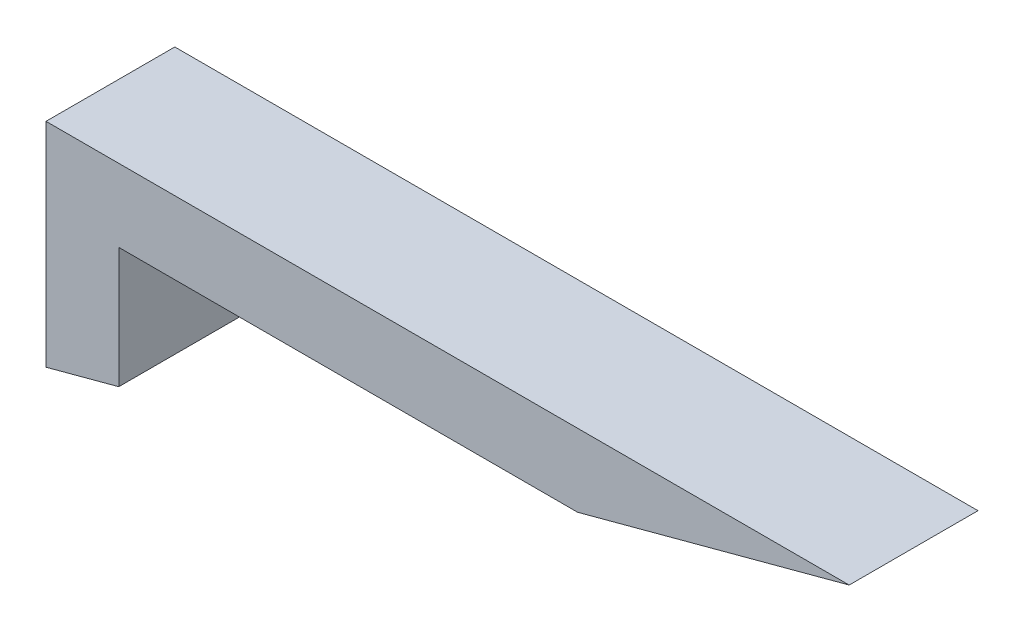
ISO-10303-21;
HEADER;
FILE_DESCRIPTION(('STEP AP214'),'2;1');
FILE_NAME('part.step','',(''),(''),'','','');
FILE_SCHEMA(('AUTOMOTIVE_DESIGN { 1 0 10303 214 1 1 1 1 }'));
ENDSEC;
DATA;
#1=APPLICATION_CONTEXT('core data for automotive mechanical design processes');
#2=APPLICATION_PROTOCOL_DEFINITION('international standard','automotive_design',2000,#1);
#3=PRODUCT_CONTEXT('',#1,'mechanical');
#4=PRODUCT('Part','Part','',(#3));
#5=PRODUCT_RELATED_PRODUCT_CATEGORY('part','',(#4));
#6=PRODUCT_DEFINITION_FORMATION('','',#4);
#7=PRODUCT_DEFINITION_CONTEXT('part definition',#1,'design');
#8=PRODUCT_DEFINITION('design','',#6,#7);
#9=PRODUCT_DEFINITION_SHAPE('','',#8);
#10=(LENGTH_UNIT() NAMED_UNIT(*) SI_UNIT(.MILLI.,.METRE.));
#11=(NAMED_UNIT(*) PLANE_ANGLE_UNIT() SI_UNIT($,.RADIAN.));
#12=(NAMED_UNIT(*) SI_UNIT($,.STERADIAN.) SOLID_ANGLE_UNIT());
#13=UNCERTAINTY_MEASURE_WITH_UNIT(LENGTH_MEASURE(1.E-05),#10,'distance_accuracy_value','');
#14=(GEOMETRIC_REPRESENTATION_CONTEXT(3) GLOBAL_UNCERTAINTY_ASSIGNED_CONTEXT((#13)) GLOBAL_UNIT_ASSIGNED_CONTEXT((#10,
#11,#12)) REPRESENTATION_CONTEXT('',''));
#15=CARTESIAN_POINT('',(0.,0.,0.));
#16=DIRECTION('',(0.,0.,1.));
#17=DIRECTION('',(1.,0.,0.));
#18=AXIS2_PLACEMENT_3D('',#15,#16,#17);
#19=CARTESIAN_POINT('',(12.7,0.,44.958));
#20=DIRECTION('',(-1.,0.,0.));
#21=DIRECTION('',(0.,-1.,0.));
#22=AXIS2_PLACEMENT_3D('',#19,#20,#21);
#23=PLANE('',#22);
#24=DIRECTION('',(0.,1.,0.));
#25=VECTOR('',#24,1.);
#26=CARTESIAN_POINT('',(12.7,0.,0.));
#27=LINE('',#26,#25);
#28=CARTESIAN_POINT('',(12.7,6.80590948775034,0.));
#29=VERTEX_POINT('',#28);
#30=CARTESIAN_POINT('',(12.7,48.9309360619142,0.));
#31=VERTEX_POINT('',#30);
#32=EDGE_CURVE('E130',#29,#31,#27,.T.);
#33=ORIENTED_EDGE('',*,*,#32,.T.);
#34=DIRECTION('',(0.,0.,-1.));
#35=VECTOR('',#34,1.);
#36=CARTESIAN_POINT('',(12.7,48.9309360619142,44.958));
#37=LINE('',#36,#35);
#38=CARTESIAN_POINT('',(12.7,48.9309360619142,44.958));
#39=VERTEX_POINT('',#38);
#40=EDGE_CURVE('E11',#39,#31,#37,.T.);
#41=ORIENTED_EDGE('',*,*,#40,.F.);
#42=DIRECTION('',(0.,1.,0.));
#43=VECTOR('',#42,1.);
#44=CARTESIAN_POINT('',(12.7,0.,44.958));
#45=LINE('',#44,#43);
#46=CARTESIAN_POINT('',(12.7,6.80590948775034,44.958));
#47=VERTEX_POINT('',#46);
#48=EDGE_CURVE('E150',#47,#39,#45,.T.);
#49=ORIENTED_EDGE('',*,*,#48,.F.);
#50=DIRECTION('',(0.,0.,-1.));
#51=VECTOR('',#50,1.);
#52=CARTESIAN_POINT('',(12.7,6.80590948775034,44.958));
#53=LINE('',#52,#51);
#54=EDGE_CURVE('E58',#47,#29,#53,.T.);
#55=ORIENTED_EDGE('',*,*,#54,.T.);
#56=EDGE_LOOP('',(#33,#41,#49,#55));
#57=FACE_BOUND('',#56,.T.);
#58=ADVANCED_FACE('F41',(#57),#23,.F.);
#59=CARTESIAN_POINT('',(0.,48.9309360619142,44.958));
#60=DIRECTION('',(0.,1.,0.));
#61=DIRECTION('',(0.,0.,1.));
#62=AXIS2_PLACEMENT_3D('',#59,#60,#61);
#63=PLANE('',#62);
#64=DIRECTION('',(1.,0.,0.));
#65=VECTOR('',#64,1.);
#66=CARTESIAN_POINT('',(0.,48.9309360619142,0.));
#67=LINE('',#66,#65);
#68=CARTESIAN_POINT('',(172.856591106213,48.9309360619142,0.));
#69=VERTEX_POINT('',#68);
#70=EDGE_CURVE('E133',#31,#69,#67,.T.);
#71=ORIENTED_EDGE('',*,*,#70,.T.);
#72=DIRECTION('',(0.,0.,-1.));
#73=VECTOR('',#72,1.);
#74=CARTESIAN_POINT('',(172.856591106213,48.9309360619142,44.958));
#75=LINE('',#74,#73);
#76=CARTESIAN_POINT('',(172.856591106213,48.9309360619142,44.958));
#77=VERTEX_POINT('',#76);
#78=EDGE_CURVE('E50',#77,#69,#75,.T.);
#79=ORIENTED_EDGE('',*,*,#78,.F.);
#80=DIRECTION('',(1.,0.,0.));
#81=VECTOR('',#80,1.);
#82=CARTESIAN_POINT('',(0.,48.9309360619142,44.958));
#83=LINE('',#82,#81);
#84=EDGE_CURVE('E90',#39,#77,#83,.T.);
#85=ORIENTED_EDGE('',*,*,#84,.F.);
#86=ORIENTED_EDGE('',*,*,#40,.T.);
#87=EDGE_LOOP('',(#71,#79,#85,#86));
#88=FACE_BOUND('',#87,.T.);
#89=ADVANCED_FACE('F160',(#88),#63,.F.);
#90=CARTESIAN_POINT('',(-0.653538017152202,2.4390370846899,44.958));
#91=DIRECTION('',(0.258819045102515,-0.96592582628907,0.));
#92=DIRECTION('',(0.96592582628907,0.258819045102515,0.));
#93=AXIS2_PLACEMENT_3D('',#90,#91,#92);
#94=PLANE('',#93);
#95=DIRECTION('',(-0.96592582628907,-0.258819045102514,0.));
#96=VECTOR('',#95,1.);
#97=CARTESIAN_POINT('',(-0.653538017152202,2.4390370846899,0.));
#98=LINE('',#97,#96);
#99=CARTESIAN_POINT('',(267.650681618465,74.3309360619142,0.));
#100=VERTEX_POINT('',#99);
#101=EDGE_CURVE('E137',#100,#69,#98,.T.);
#102=ORIENTED_EDGE('',*,*,#101,.F.);
#103=DIRECTION('',(0.,0.,-1.));
#104=VECTOR('',#103,1.);
#105=CARTESIAN_POINT('',(267.650681618465,74.3309360619142,44.958));
#106=LINE('',#105,#104);
#107=CARTESIAN_POINT('',(267.650681618465,74.3309360619142,44.958));
#108=VERTEX_POINT('',#107);
#109=EDGE_CURVE('E110',#108,#100,#106,.T.);
#110=ORIENTED_EDGE('',*,*,#109,.F.);
#111=DIRECTION('',(-0.96592582628907,-0.258819045102514,0.));
#112=VECTOR('',#111,1.);
#113=CARTESIAN_POINT('',(-0.653538017152202,2.4390370846899,44.958));
#114=LINE('',#113,#112);
#115=EDGE_CURVE('E119',#108,#77,#114,.T.);
#116=ORIENTED_EDGE('',*,*,#115,.T.);
#117=ORIENTED_EDGE('',*,*,#78,.T.);
#118=EDGE_LOOP('',(#102,#110,#116,#117));
#119=FACE_BOUND('',#118,.T.);
#120=ADVANCED_FACE('F159',(#119),#94,.T.);
#121=CARTESIAN_POINT('',(0.,74.3309360619142,44.958));
#122=DIRECTION('',(0.,1.,0.));
#123=DIRECTION('',(0.,0.,1.));
#124=AXIS2_PLACEMENT_3D('',#121,#122,#123);
#125=PLANE('',#124);
#126=DIRECTION('',(1.,0.,0.));
#127=VECTOR('',#126,1.);
#128=CARTESIAN_POINT('',(0.,74.3309360619142,0.));
#129=LINE('',#128,#127);
#130=CARTESIAN_POINT('',(-12.7,74.3309360619142,0.));
#131=VERTEX_POINT('',#130);
#132=EDGE_CURVE('E105',#131,#100,#129,.T.);
#133=ORIENTED_EDGE('',*,*,#132,.F.);
#134=DIRECTION('',(0.,0.,-1.));
#135=VECTOR('',#134,1.);
#136=CARTESIAN_POINT('',(-12.7,74.3309360619142,44.958));
#137=LINE('',#136,#135);
#138=CARTESIAN_POINT('',(-12.7,74.3309360619142,44.958));
#139=VERTEX_POINT('',#138);
#140=EDGE_CURVE('E100',#139,#131,#137,.T.);
#141=ORIENTED_EDGE('',*,*,#140,.F.);
#142=DIRECTION('',(1.,0.,0.));
#143=VECTOR('',#142,1.);
#144=CARTESIAN_POINT('',(0.,74.3309360619142,44.958));
#145=LINE('',#144,#143);
#146=EDGE_CURVE('E103',#139,#108,#145,.T.);
#147=ORIENTED_EDGE('',*,*,#146,.T.);
#148=ORIENTED_EDGE('',*,*,#109,.T.);
#149=EDGE_LOOP('',(#133,#141,#147,#148));
#150=FACE_BOUND('',#149,.T.);
#151=ADVANCED_FACE('F102',(#150),#125,.T.);
#152=CARTESIAN_POINT('',(-12.7,0.,44.958));
#153=DIRECTION('',(-1.,0.,0.));
#154=DIRECTION('',(0.,-1.,0.));
#155=AXIS2_PLACEMENT_3D('',#152,#153,#154);
#156=PLANE('',#155);
#157=DIRECTION('',(0.,1.,0.));
#158=VECTOR('',#157,1.);
#159=CARTESIAN_POINT('',(-12.7,0.,0.));
#160=LINE('',#159,#158);
#161=CARTESIAN_POINT('',(-12.7,0.,0.));
#162=VERTEX_POINT('',#161);
#163=EDGE_CURVE('E143',#162,#131,#160,.T.);
#164=ORIENTED_EDGE('',*,*,#163,.F.);
#165=DIRECTION('',(0.,0.,-1.));
#166=VECTOR('',#165,1.);
#167=CARTESIAN_POINT('',(-12.7,0.,44.958));
#168=LINE('',#167,#166);
#169=CARTESIAN_POINT('',(-12.7,0.,44.958));
#170=VERTEX_POINT('',#169);
#171=EDGE_CURVE('E78',#170,#162,#168,.T.);
#172=ORIENTED_EDGE('',*,*,#171,.F.);
#173=DIRECTION('',(0.,1.,0.));
#174=VECTOR('',#173,1.);
#175=CARTESIAN_POINT('',(-12.7,0.,44.958));
#176=LINE('',#175,#174);
#177=EDGE_CURVE('E117',#170,#139,#176,.T.);
#178=ORIENTED_EDGE('',*,*,#177,.T.);
#179=ORIENTED_EDGE('',*,*,#140,.T.);
#180=EDGE_LOOP('',(#164,#172,#178,#179));
#181=FACE_BOUND('',#180,.T.);
#182=ADVANCED_FACE('F122',(#181),#156,.T.);
#183=CARTESIAN_POINT('',(-0.850738685968774,3.17499999999993,44.958));
#184=DIRECTION('',(0.258819045102515,-0.96592582628907,0.));
#185=DIRECTION('',(0.96592582628907,0.258819045102515,0.));
#186=AXIS2_PLACEMENT_3D('',#183,#184,#185);
#187=PLANE('',#186);
#188=DIRECTION('',(-0.96592582628907,-0.258819045102515,0.));
#189=VECTOR('',#188,1.);
#190=CARTESIAN_POINT('',(-0.850738685968774,3.17499999999993,0.));
#191=LINE('',#190,#189);
#192=EDGE_CURVE('E146',#29,#162,#191,.T.);
#193=ORIENTED_EDGE('',*,*,#192,.F.);
#194=ORIENTED_EDGE('',*,*,#54,.F.);
#195=DIRECTION('',(-0.96592582628907,-0.258819045102515,0.));
#196=VECTOR('',#195,1.);
#197=CARTESIAN_POINT('',(-0.850738685968774,3.17499999999993,44.958));
#198=LINE('',#197,#196);
#199=EDGE_CURVE('E124',#47,#170,#198,.T.);
#200=ORIENTED_EDGE('',*,*,#199,.T.);
#201=ORIENTED_EDGE('',*,*,#171,.T.);
#202=EDGE_LOOP('',(#193,#194,#200,#201));
#203=FACE_BOUND('',#202,.T.);
#204=ADVANCED_FACE('F164',(#203),#187,.T.);
#205=CARTESIAN_POINT('',(0.,0.,44.958));
#206=DIRECTION('',(0.,0.,1.));
#207=DIRECTION('',(1.,0.,0.));
#208=AXIS2_PLACEMENT_3D('',#205,#206,#207);
#209=PLANE('',#208);
#210=ORIENTED_EDGE('',*,*,#48,.T.);
#211=ORIENTED_EDGE('',*,*,#84,.T.);
#212=ORIENTED_EDGE('',*,*,#115,.F.);
#213=ORIENTED_EDGE('',*,*,#146,.F.);
#214=ORIENTED_EDGE('',*,*,#177,.F.);
#215=ORIENTED_EDGE('',*,*,#199,.F.);
#216=EDGE_LOOP('',(#210,#211,#212,#213,#214,#215));
#217=FACE_BOUND('',#216,.T.);
#218=ADVANCED_FACE('F115',(#217),#209,.T.);
#219=CARTESIAN_POINT('',(0.,0.,0.));
#220=DIRECTION('',(0.,0.,1.));
#221=DIRECTION('',(1.,0.,0.));
#222=AXIS2_PLACEMENT_3D('',#219,#220,#221);
#223=PLANE('',#222);
#224=ORIENTED_EDGE('',*,*,#32,.F.);
#225=ORIENTED_EDGE('',*,*,#192,.T.);
#226=ORIENTED_EDGE('',*,*,#163,.T.);
#227=ORIENTED_EDGE('',*,*,#132,.T.);
#228=ORIENTED_EDGE('',*,*,#101,.T.);
#229=ORIENTED_EDGE('',*,*,#70,.F.);
#230=EDGE_LOOP('',(#224,#225,#226,#227,#228,#229));
#231=FACE_BOUND('',#230,.T.);
#232=ADVANCED_FACE('F163',(#231),#223,.F.);
#233=CLOSED_SHELL('',(#58,#89,#120,#151,#182,#204,#218,#232));
#234=MANIFOLD_SOLID_BREP('B2',#233);
#235=ADVANCED_BREP_SHAPE_REPRESENTATION('',(#18,#234),#14);
#236=SHAPE_DEFINITION_REPRESENTATION(#9,#235);
ENDSEC;
END-ISO-10303-21;
